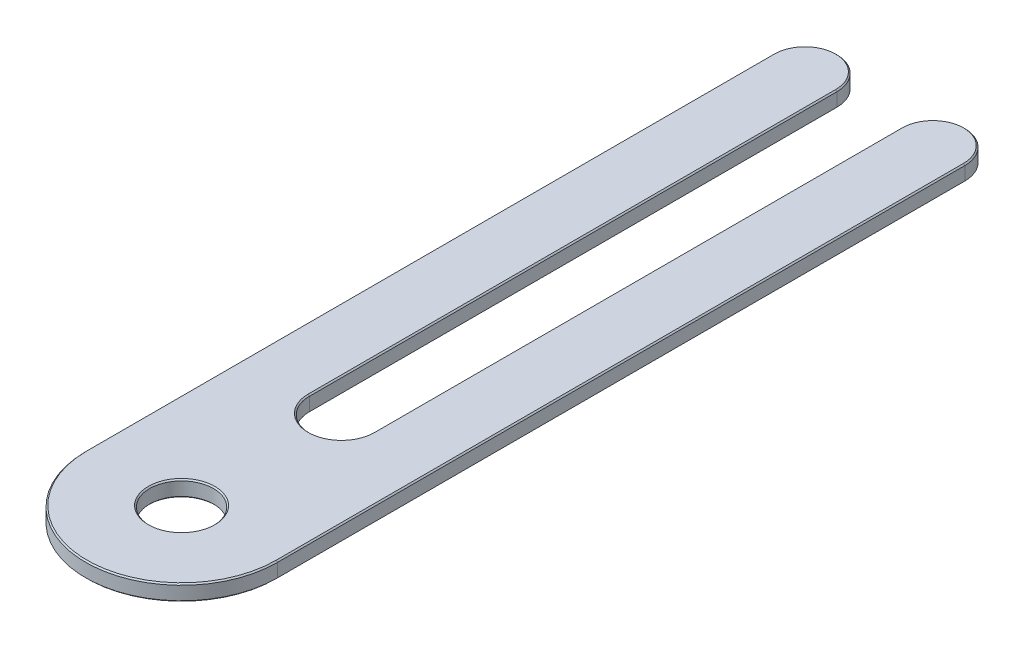
ISO-10303-21;
HEADER;
FILE_DESCRIPTION(('STEP AP214'),'2;1');
FILE_NAME('part.step','',(''),(''),'','','');
FILE_SCHEMA(('AUTOMOTIVE_DESIGN { 1 0 10303 214 1 1 1 1 }'));
ENDSEC;
DATA;
#1=APPLICATION_CONTEXT('core data for automotive mechanical design processes');
#2=APPLICATION_PROTOCOL_DEFINITION('international standard','automotive_design',2000,#1);
#3=PRODUCT_CONTEXT('',#1,'mechanical');
#4=PRODUCT('Part','Part','',(#3));
#5=PRODUCT_RELATED_PRODUCT_CATEGORY('part','',(#4));
#6=PRODUCT_DEFINITION_FORMATION('','',#4);
#7=PRODUCT_DEFINITION_CONTEXT('part definition',#1,'design');
#8=PRODUCT_DEFINITION('design','',#6,#7);
#9=PRODUCT_DEFINITION_SHAPE('','',#8);
#10=(LENGTH_UNIT() NAMED_UNIT(*) SI_UNIT(.MILLI.,.METRE.));
#11=(NAMED_UNIT(*) PLANE_ANGLE_UNIT() SI_UNIT($,.RADIAN.));
#12=(NAMED_UNIT(*) SI_UNIT($,.STERADIAN.) SOLID_ANGLE_UNIT());
#13=UNCERTAINTY_MEASURE_WITH_UNIT(LENGTH_MEASURE(1.E-05),#10,'distance_accuracy_value','');
#14=(GEOMETRIC_REPRESENTATION_CONTEXT(3) GLOBAL_UNCERTAINTY_ASSIGNED_CONTEXT((#13)) GLOBAL_UNIT_ASSIGNED_CONTEXT((#10,
#11,#12)) REPRESENTATION_CONTEXT('',''));
#15=CARTESIAN_POINT('',(0.,0.,0.));
#16=DIRECTION('',(0.,0.,1.));
#17=DIRECTION('',(1.,0.,0.));
#18=AXIS2_PLACEMENT_3D('',#15,#16,#17);
#19=CARTESIAN_POINT('',(0.,1.58749999999999,0.));
#20=DIRECTION('',(0.,1.,0.));
#21=DIRECTION('',(0.,0.,1.00000000000001));
#22=AXIS2_PLACEMENT_3D('',#19,#20,#21);
#23=PLANE('',#22);
#24=DIRECTION('',(0.,0.,1.00000000000001));
#25=VECTOR('',#24,1.);
#26=CARTESIAN_POINT('',(6.60400000000003,1.58749999999999,0.));
#27=LINE('',#26,#25);
#28=CARTESIAN_POINT('',(6.60400000000001,1.58749999999999,-104.775000000001));
#29=VERTEX_POINT('',#28);
#30=CARTESIAN_POINT('',(6.60400000000003,1.58749999999999,0.));
#31=VERTEX_POINT('',#30);
#32=EDGE_CURVE('E593',#29,#31,#27,.T.);
#33=ORIENTED_EDGE('',*,*,#32,.T.);
#34=CARTESIAN_POINT('',(0.,1.58749999999999,0.));
#35=DIRECTION('',(0.,1.,0.));
#36=DIRECTION('',(0.,0.,1.00000000000001));
#37=AXIS2_PLACEMENT_3D('',#34,#35,#36);
#38=CIRCLE('',#37,6.60399999999999);
#39=CARTESIAN_POINT('',(-6.60400000000001,1.58749999999999,0.));
#40=VERTEX_POINT('',#39);
#41=EDGE_CURVE('E854',#31,#40,#38,.F.);
#42=ORIENTED_EDGE('',*,*,#41,.T.);
#43=DIRECTION('',(0.,0.,-1.00000000000001));
#44=VECTOR('',#43,1.);
#45=CARTESIAN_POINT('',(-6.60400000000002,1.58749999999999,-104.775000000001));
#46=LINE('',#45,#44);
#47=CARTESIAN_POINT('',(-6.60400000000001,1.58749999999999,-104.775000000001));
#48=VERTEX_POINT('',#47);
#49=EDGE_CURVE('E714',#40,#48,#46,.T.);
#50=ORIENTED_EDGE('',*,*,#49,.T.);
#51=CARTESIAN_POINT('',(-12.7000000000001,1.58749999999999,-104.775000000001));
#52=DIRECTION('',(0.,1.,0.));
#53=DIRECTION('',(0.,0.,1.00000000000001));
#54=AXIS2_PLACEMENT_3D('',#51,#52,#53);
#55=CIRCLE('',#54,6.09600000000001);
#56=CARTESIAN_POINT('',(-18.7960000000002,1.58749999999999,-104.775000000001));
#57=VERTEX_POINT('',#56);
#58=EDGE_CURVE('E850',#48,#57,#55,.T.);
#59=ORIENTED_EDGE('',*,*,#58,.T.);
#60=DIRECTION('',(0.,0.,1.00000000000001));
#61=VECTOR('',#60,1.);
#62=CARTESIAN_POINT('',(-18.7960000000002,1.58749999999995,31.7500000000002));
#63=LINE('',#62,#61);
#64=CARTESIAN_POINT('',(-18.7960000000002,1.58749999999995,31.7500000000002));
#65=VERTEX_POINT('',#64);
#66=EDGE_CURVE('E846',#57,#65,#63,.T.);
#67=ORIENTED_EDGE('',*,*,#66,.T.);
#68=CARTESIAN_POINT('',(0.,1.58749999999992,31.7500000000002));
#69=DIRECTION('',(0.,1.,0.));
#70=DIRECTION('',(0.,0.,1.00000000000001));
#71=AXIS2_PLACEMENT_3D('',#68,#69,#70);
#72=CIRCLE('',#71,18.796);
#73=CARTESIAN_POINT('',(18.7960000000001,1.58749999999992,31.7500000000002));
#74=VERTEX_POINT('',#73);
#75=EDGE_CURVE('E842',#65,#74,#72,.T.);
#76=ORIENTED_EDGE('',*,*,#75,.T.);
#77=DIRECTION('',(0.,0.,-1.00000000000001));
#78=VECTOR('',#77,1.);
#79=CARTESIAN_POINT('',(18.7960000000001,1.5874999999998,-104.775000000001));
#80=LINE('',#79,#78);
#81=CARTESIAN_POINT('',(18.7960000000001,1.5874999999998,-104.775000000001));
#82=VERTEX_POINT('',#81);
#83=EDGE_CURVE('E844',#74,#82,#80,.T.);
#84=ORIENTED_EDGE('',*,*,#83,.T.);
#85=CARTESIAN_POINT('',(12.7000000000001,1.5874999999998,-104.775000000001));
#86=DIRECTION('',(0.,1.,0.));
#87=DIRECTION('',(0.,0.,1.00000000000001));
#88=AXIS2_PLACEMENT_3D('',#85,#86,#87);
#89=CIRCLE('',#88,6.09600000000001);
#90=EDGE_CURVE('E848',#82,#29,#89,.T.);
#91=ORIENTED_EDGE('',*,*,#90,.T.);
#92=EDGE_LOOP('',(#33,#42,#50,#59,#67,#76,#84,#91));
#93=FACE_BOUND('',#92,.T.);
#94=CARTESIAN_POINT('',(0.,1.58749999999992,31.7500000000002));
#95=DIRECTION('',(0.,1.,0.));
#96=DIRECTION('',(0.,0.,1.00000000000001));
#97=AXIS2_PLACEMENT_3D('',#94,#95,#96);
#98=CIRCLE('',#97,6.604);
#99=CARTESIAN_POINT('',(0.,1.58749999999992,38.3540000000002));
#100=VERTEX_POINT('',#99);
#101=EDGE_CURVE('E839',#100,#100,#98,.F.);
#102=ORIENTED_EDGE('',*,*,#101,.T.);
#103=EDGE_LOOP('',(#102));
#104=FACE_BOUND('',#103,.T.);
#105=ADVANCED_FACE('F568',(#93,#104),#23,.T.);
#106=CARTESIAN_POINT('',(0.,-1.58749999999999,0.));
#107=DIRECTION('',(0.,1.,0.));
#108=DIRECTION('',(0.,0.,1.00000000000001));
#109=AXIS2_PLACEMENT_3D('',#106,#107,#108);
#110=PLANE('',#109);
#111=DIRECTION('',(0.,0.,1.00000000000001));
#112=VECTOR('',#111,1.);
#113=CARTESIAN_POINT('',(-6.60399999999998,-1.58749999999999,0.));
#114=LINE('',#113,#112);
#115=CARTESIAN_POINT('',(-6.60399999999999,-1.58750000000002,-104.775000000001));
#116=VERTEX_POINT('',#115);
#117=CARTESIAN_POINT('',(-6.60399999999998,-1.58749999999999,0.));
#118=VERTEX_POINT('',#117);
#119=EDGE_CURVE('E810',#116,#118,#114,.T.);
#120=ORIENTED_EDGE('',*,*,#119,.T.);
#121=CARTESIAN_POINT('',(0.,-1.58749999999999,0.));
#122=DIRECTION('',(0.,1.,0.));
#123=DIRECTION('',(0.,0.,1.00000000000001));
#124=AXIS2_PLACEMENT_3D('',#121,#122,#123);
#125=CIRCLE('',#124,6.60399999999996);
#126=CARTESIAN_POINT('',(6.604,-1.58749999999999,0.));
#127=VERTEX_POINT('',#126);
#128=EDGE_CURVE('E697',#118,#127,#125,.T.);
#129=ORIENTED_EDGE('',*,*,#128,.T.);
#130=DIRECTION('',(0.,0.,-1.00000000000001));
#131=VECTOR('',#130,1.);
#132=CARTESIAN_POINT('',(6.604,-1.58749999999999,0.));
#133=LINE('',#132,#131);
#134=CARTESIAN_POINT('',(6.60399999999998,-1.58750000000002,-104.775000000001));
#135=VERTEX_POINT('',#134);
#136=EDGE_CURVE('E808',#127,#135,#133,.T.);
#137=ORIENTED_EDGE('',*,*,#136,.T.);
#138=CARTESIAN_POINT('',(12.7000000000001,-1.58750000000021,-104.775000000001));
#139=DIRECTION('',(0.,1.,0.));
#140=DIRECTION('',(0.,0.,1.00000000000001));
#141=AXIS2_PLACEMENT_3D('',#138,#139,#140);
#142=CIRCLE('',#141,6.09600000000004);
#143=CARTESIAN_POINT('',(18.7960000000001,-1.58750000000021,-104.775000000001));
#144=VERTEX_POINT('',#143);
#145=EDGE_CURVE('E804',#135,#144,#142,.F.);
#146=ORIENTED_EDGE('',*,*,#145,.T.);
#147=DIRECTION('',(0.,0.,1.00000000000001));
#148=VECTOR('',#147,1.);
#149=CARTESIAN_POINT('',(18.7960000000001,-1.58749999999999,0.));
#150=LINE('',#149,#148);
#151=CARTESIAN_POINT('',(18.7960000000002,-1.58750000000006,31.7500000000002));
#152=VERTEX_POINT('',#151);
#153=EDGE_CURVE('E800',#144,#152,#150,.T.);
#154=ORIENTED_EDGE('',*,*,#153,.T.);
#155=CARTESIAN_POINT('',(0.,-1.58750000000006,31.7500000000002));
#156=DIRECTION('',(0.,1.,0.));
#157=DIRECTION('',(0.,0.,1.00000000000001));
#158=AXIS2_PLACEMENT_3D('',#155,#156,#157);
#159=CIRCLE('',#158,18.796);
#160=CARTESIAN_POINT('',(-18.7960000000002,-1.58750000000006,31.7500000000002));
#161=VERTEX_POINT('',#160);
#162=EDGE_CURVE('E798',#152,#161,#159,.F.);
#163=ORIENTED_EDGE('',*,*,#162,.T.);
#164=DIRECTION('',(0.,0.,-1.00000000000001));
#165=VECTOR('',#164,1.);
#166=CARTESIAN_POINT('',(-18.7960000000002,-1.58749999999999,0.));
#167=LINE('',#166,#165);
#168=CARTESIAN_POINT('',(-18.7960000000002,-1.58750000000002,-104.775000000001));
#169=VERTEX_POINT('',#168);
#170=EDGE_CURVE('E802',#161,#169,#167,.T.);
#171=ORIENTED_EDGE('',*,*,#170,.T.);
#172=CARTESIAN_POINT('',(-12.7000000000001,-1.58750000000002,-104.775000000001));
#173=DIRECTION('',(0.,1.,0.));
#174=DIRECTION('',(0.,0.,1.00000000000001));
#175=AXIS2_PLACEMENT_3D('',#172,#173,#174);
#176=CIRCLE('',#175,6.09600000000004);
#177=EDGE_CURVE('E806',#169,#116,#176,.F.);
#178=ORIENTED_EDGE('',*,*,#177,.T.);
#179=EDGE_LOOP('',(#120,#129,#137,#146,#154,#163,#171,#178));
#180=FACE_BOUND('',#179,.T.);
#181=CARTESIAN_POINT('',(0.,-1.58750000000006,31.7500000000002));
#182=DIRECTION('',(0.,1.,0.));
#183=DIRECTION('',(0.,0.,1.00000000000001));
#184=AXIS2_PLACEMENT_3D('',#181,#182,#183);
#185=CIRCLE('',#184,6.604);
#186=CARTESIAN_POINT('',(0.,-1.58750000000006,38.3540000000002));
#187=VERTEX_POINT('',#186);
#188=EDGE_CURVE('E795',#187,#187,#185,.T.);
#189=ORIENTED_EDGE('',*,*,#188,.T.);
#190=EDGE_LOOP('',(#189));
#191=FACE_BOUND('',#190,.T.);
#192=ADVANCED_FACE('F869',(#180,#191),#110,.F.);
#193=CARTESIAN_POINT('',(0.,1.58749999999999,0.));
#194=DIRECTION('',(0.,-1.,0.));
#195=DIRECTION('',(0.,0.,-1.00000000000001));
#196=AXIS2_PLACEMENT_3D('',#193,#194,#195);
#197=CYLINDRICAL_SURFACE('',#196,6.35);
#198=DIRECTION('',(0.,-1.,0.));
#199=VECTOR('',#198,1.);
#200=CARTESIAN_POINT('',(6.35000000000004,1.58749999999999,0.));
#201=LINE('',#200,#199);
#202=CARTESIAN_POINT('',(6.35000000000004,1.33350000000002,0.));
#203=VERTEX_POINT('',#202);
#204=CARTESIAN_POINT('',(6.35000000000004,-1.33350000000004,0.));
#205=VERTEX_POINT('',#204);
#206=EDGE_CURVE('E770',#203,#205,#201,.T.);
#207=ORIENTED_EDGE('',*,*,#206,.T.);
#208=CARTESIAN_POINT('',(0.,-1.33350000000004,0.));
#209=DIRECTION('',(0.,1.,0.));
#210=DIRECTION('',(0.,0.,1.00000000000001));
#211=AXIS2_PLACEMENT_3D('',#208,#209,#210);
#212=CIRCLE('',#211,6.35);
#213=CARTESIAN_POINT('',(-6.35000000000002,-1.33350000000004,0.));
#214=VERTEX_POINT('',#213);
#215=EDGE_CURVE('E707',#205,#214,#212,.F.);
#216=ORIENTED_EDGE('',*,*,#215,.T.);
#217=DIRECTION('',(0.,-1.,0.));
#218=VECTOR('',#217,1.);
#219=CARTESIAN_POINT('',(-6.35000000000002,1.58749999999999,0.));
#220=LINE('',#219,#218);
#221=CARTESIAN_POINT('',(-6.35000000000002,1.33350000000002,0.));
#222=VERTEX_POINT('',#221);
#223=EDGE_CURVE('E690',#222,#214,#220,.T.);
#224=ORIENTED_EDGE('',*,*,#223,.F.);
#225=CARTESIAN_POINT('',(0.,1.33350000000002,0.));
#226=DIRECTION('',(0.,1.,0.));
#227=DIRECTION('',(0.,0.,1.00000000000001));
#228=AXIS2_PLACEMENT_3D('',#225,#226,#227);
#229=CIRCLE('',#228,6.35);
#230=EDGE_CURVE('E704',#222,#203,#229,.T.);
#231=ORIENTED_EDGE('',*,*,#230,.T.);
#232=EDGE_LOOP('',(#207,#216,#224,#231));
#233=FACE_BOUND('',#232,.T.);
#234=ADVANCED_FACE('F703',(#233),#197,.F.);
#235=CARTESIAN_POINT('',(-6.35000000000002,1.58749999999999,0.));
#236=DIRECTION('',(-1.00000000000001,0.,0.));
#237=DIRECTION('',(0.,0.,1.00000000000001));
#238=AXIS2_PLACEMENT_3D('',#235,#236,#237);
#239=PLANE('',#238);
#240=ORIENTED_EDGE('',*,*,#223,.T.);
#241=DIRECTION('',(0.,0.,-1.00000000000001));
#242=VECTOR('',#241,1.);
#243=CARTESIAN_POINT('',(-6.35000000000002,-1.33350000000004,0.));
#244=LINE('',#243,#242);
#245=CARTESIAN_POINT('',(-6.35000000000003,-1.33350000000004,-104.775000000001));
#246=VERTEX_POINT('',#245);
#247=EDGE_CURVE('E696',#214,#246,#244,.T.);
#248=ORIENTED_EDGE('',*,*,#247,.T.);
#249=DIRECTION('',(0.,-1.,0.));
#250=VECTOR('',#249,1.);
#251=CARTESIAN_POINT('',(-6.35000000000003,1.58749999999999,-104.775000000001));
#252=LINE('',#251,#250);
#253=CARTESIAN_POINT('',(-6.35000000000003,1.33349999999999,-104.775000000001));
#254=VERTEX_POINT('',#253);
#255=EDGE_CURVE('E692',#254,#246,#252,.T.);
#256=ORIENTED_EDGE('',*,*,#255,.F.);
#257=DIRECTION('',(0.,0.,1.00000000000001));
#258=VECTOR('',#257,1.);
#259=CARTESIAN_POINT('',(-6.35000000000002,1.33350000000002,0.));
#260=LINE('',#259,#258);
#261=EDGE_CURVE('E687',#254,#222,#260,.T.);
#262=ORIENTED_EDGE('',*,*,#261,.T.);
#263=EDGE_LOOP('',(#240,#248,#256,#262));
#264=FACE_BOUND('',#263,.T.);
#265=ADVANCED_FACE('F689',(#264),#239,.F.);
#266=CARTESIAN_POINT('',(-12.7000000000001,1.58749999999999,-104.775000000001));
#267=DIRECTION('',(0.,-1.,0.));
#268=DIRECTION('',(0.,0.,-1.00000000000001));
#269=AXIS2_PLACEMENT_3D('',#266,#267,#268);
#270=CYLINDRICAL_SURFACE('',#269,6.35);
#271=ORIENTED_EDGE('',*,*,#255,.T.);
#272=CARTESIAN_POINT('',(-12.7000000000001,-1.33350000000004,-104.775000000001));
#273=DIRECTION('',(0.,1.,0.));
#274=DIRECTION('',(0.,0.,1.00000000000001));
#275=AXIS2_PLACEMENT_3D('',#272,#273,#274);
#276=CIRCLE('',#275,6.35);
#277=CARTESIAN_POINT('',(-19.0500000000001,-1.33350000000004,-104.775000000001));
#278=VERTEX_POINT('',#277);
#279=EDGE_CURVE('E821',#246,#278,#276,.T.);
#280=ORIENTED_EDGE('',*,*,#279,.T.);
#281=DIRECTION('',(0.,-1.,0.));
#282=VECTOR('',#281,1.);
#283=CARTESIAN_POINT('',(-19.0500000000001,1.58749999999999,-104.775000000001));
#284=LINE('',#283,#282);
#285=CARTESIAN_POINT('',(-19.0500000000001,1.33349999999999,-104.775000000001));
#286=VERTEX_POINT('',#285);
#287=EDGE_CURVE('E790',#286,#278,#284,.T.);
#288=ORIENTED_EDGE('',*,*,#287,.F.);
#289=CARTESIAN_POINT('',(-12.7000000000001,1.33349999999999,-104.775000000001));
#290=DIRECTION('',(0.,1.,0.));
#291=DIRECTION('',(0.,0.,1.00000000000001));
#292=AXIS2_PLACEMENT_3D('',#289,#290,#291);
#293=CIRCLE('',#292,6.35);
#294=EDGE_CURVE('E819',#286,#254,#293,.F.);
#295=ORIENTED_EDGE('',*,*,#294,.T.);
#296=EDGE_LOOP('',(#271,#280,#288,#295));
#297=FACE_BOUND('',#296,.T.);
#298=ADVANCED_FACE('F898',(#297),#270,.T.);
#299=CARTESIAN_POINT('',(-19.0500000000001,1.58749999999999,-104.775000000001));
#300=DIRECTION('',(1.00000000000001,0.,0.));
#301=DIRECTION('',(0.,0.,-1.00000000000001));
#302=AXIS2_PLACEMENT_3D('',#299,#300,#301);
#303=PLANE('',#302);
#304=ORIENTED_EDGE('',*,*,#287,.T.);
#305=DIRECTION('',(0.,0.,1.00000000000001));
#306=VECTOR('',#305,1.);
#307=CARTESIAN_POINT('',(-19.0500000000001,-1.33350000000004,-104.775000000001));
#308=LINE('',#307,#306);
#309=CARTESIAN_POINT('',(-19.0500000000002,-1.33350000000008,31.7500000000003));
#310=VERTEX_POINT('',#309);
#311=EDGE_CURVE('E829',#278,#310,#308,.T.);
#312=ORIENTED_EDGE('',*,*,#311,.T.);
#313=DIRECTION('',(0.,-1.,0.));
#314=VECTOR('',#313,1.);
#315=CARTESIAN_POINT('',(-19.0500000000002,1.58749999999995,31.7500000000003));
#316=LINE('',#315,#314);
#317=CARTESIAN_POINT('',(-19.0500000000002,1.33349999999995,31.7500000000003));
#318=VERTEX_POINT('',#317);
#319=EDGE_CURVE('E787',#318,#310,#316,.T.);
#320=ORIENTED_EDGE('',*,*,#319,.F.);
#321=DIRECTION('',(0.,0.,-1.00000000000001));
#322=VECTOR('',#321,1.);
#323=CARTESIAN_POINT('',(-19.0500000000001,1.33349999999999,-104.775000000001));
#324=LINE('',#323,#322);
#325=EDGE_CURVE('E827',#318,#286,#324,.T.);
#326=ORIENTED_EDGE('',*,*,#325,.T.);
#327=EDGE_LOOP('',(#304,#312,#320,#326));
#328=FACE_BOUND('',#327,.T.);
#329=ADVANCED_FACE('F894',(#328),#303,.F.);
#330=CARTESIAN_POINT('',(0.,1.58749999999992,31.7500000000002));
#331=DIRECTION('',(0.,-1.,0.));
#332=DIRECTION('',(0.,0.,-1.00000000000001));
#333=AXIS2_PLACEMENT_3D('',#330,#331,#332);
#334=CYLINDRICAL_SURFACE('',#333,19.05);
#335=ORIENTED_EDGE('',*,*,#319,.T.);
#336=CARTESIAN_POINT('',(0.,-1.33350000000008,31.7500000000002));
#337=DIRECTION('',(0.,1.,0.));
#338=DIRECTION('',(0.,0.,1.00000000000001));
#339=AXIS2_PLACEMENT_3D('',#336,#337,#338);
#340=CIRCLE('',#339,19.05);
#341=CARTESIAN_POINT('',(19.0500000000001,-1.33350000000008,31.7500000000002));
#342=VERTEX_POINT('',#341);
#343=EDGE_CURVE('E837',#310,#342,#340,.T.);
#344=ORIENTED_EDGE('',*,*,#343,.T.);
#345=DIRECTION('',(0.,-1.,0.));
#346=VECTOR('',#345,1.);
#347=CARTESIAN_POINT('',(19.0500000000001,1.58749999999992,31.7500000000002));
#348=LINE('',#347,#346);
#349=CARTESIAN_POINT('',(19.0500000000001,1.33349999999995,31.7500000000002));
#350=VERTEX_POINT('',#349);
#351=EDGE_CURVE('E784',#350,#342,#348,.T.);
#352=ORIENTED_EDGE('',*,*,#351,.F.);
#353=CARTESIAN_POINT('',(0.,1.33349999999995,31.7500000000002));
#354=DIRECTION('',(0.,1.,0.));
#355=DIRECTION('',(0.,0.,1.00000000000001));
#356=AXIS2_PLACEMENT_3D('',#353,#354,#355);
#357=CIRCLE('',#356,19.05);
#358=EDGE_CURVE('E835',#350,#318,#357,.F.);
#359=ORIENTED_EDGE('',*,*,#358,.T.);
#360=EDGE_LOOP('',(#335,#344,#352,#359));
#361=FACE_BOUND('',#360,.T.);
#362=ADVANCED_FACE('F890',(#361),#334,.T.);
#363=CARTESIAN_POINT('',(19.0500000000001,1.5874999999998,-104.775000000001));
#364=DIRECTION('',(-1.00000000000001,0.,0.));
#365=DIRECTION('',(0.,0.,1.00000000000001));
#366=AXIS2_PLACEMENT_3D('',#363,#364,#365);
#367=PLANE('',#366);
#368=ORIENTED_EDGE('',*,*,#351,.T.);
#369=DIRECTION('',(0.,0.,-1.00000000000001));
#370=VECTOR('',#369,1.);
#371=CARTESIAN_POINT('',(19.0500000000001,-1.33350000000024,-104.775000000001));
#372=LINE('',#371,#370);
#373=CARTESIAN_POINT('',(19.0500000000001,-1.33350000000024,-104.775000000001));
#374=VERTEX_POINT('',#373);
#375=EDGE_CURVE('E833',#342,#374,#372,.T.);
#376=ORIENTED_EDGE('',*,*,#375,.T.);
#377=DIRECTION('',(0.,-1.,0.));
#378=VECTOR('',#377,1.);
#379=CARTESIAN_POINT('',(19.0500000000001,1.5874999999998,-104.775000000001));
#380=LINE('',#379,#378);
#381=CARTESIAN_POINT('',(19.0500000000001,1.33349999999979,-104.775000000001));
#382=VERTEX_POINT('',#381);
#383=EDGE_CURVE('E779',#382,#374,#380,.T.);
#384=ORIENTED_EDGE('',*,*,#383,.F.);
#385=DIRECTION('',(0.,0.,1.00000000000001));
#386=VECTOR('',#385,1.);
#387=CARTESIAN_POINT('',(19.0500000000001,1.33349999999995,31.7500000000002));
#388=LINE('',#387,#386);
#389=EDGE_CURVE('E831',#382,#350,#388,.T.);
#390=ORIENTED_EDGE('',*,*,#389,.T.);
#391=EDGE_LOOP('',(#368,#376,#384,#390));
#392=FACE_BOUND('',#391,.T.);
#393=ADVANCED_FACE('F886',(#392),#367,.F.);
#394=CARTESIAN_POINT('',(12.7000000000001,1.5874999999998,-104.775000000001));
#395=DIRECTION('',(0.,-1.,0.));
#396=DIRECTION('',(0.,0.,-1.00000000000001));
#397=AXIS2_PLACEMENT_3D('',#394,#395,#396);
#398=CYLINDRICAL_SURFACE('',#397,6.35);
#399=ORIENTED_EDGE('',*,*,#383,.T.);
#400=CARTESIAN_POINT('',(12.7000000000001,-1.33350000000024,-104.775000000001));
#401=DIRECTION('',(0.,1.,0.));
#402=DIRECTION('',(0.,0.,1.00000000000001));
#403=AXIS2_PLACEMENT_3D('',#400,#401,#402);
#404=CIRCLE('',#403,6.35);
#405=CARTESIAN_POINT('',(6.35000000000003,-1.33350000000004,-104.775000000001));
#406=VERTEX_POINT('',#405);
#407=EDGE_CURVE('E825',#374,#406,#404,.T.);
#408=ORIENTED_EDGE('',*,*,#407,.T.);
#409=DIRECTION('',(0.,-1.,0.));
#410=VECTOR('',#409,1.);
#411=CARTESIAN_POINT('',(6.35000000000003,1.58749999999999,-104.775000000001));
#412=LINE('',#411,#410);
#413=CARTESIAN_POINT('',(6.35000000000003,1.33349999999999,-104.775000000001));
#414=VERTEX_POINT('',#413);
#415=EDGE_CURVE('E775',#414,#406,#412,.T.);
#416=ORIENTED_EDGE('',*,*,#415,.F.);
#417=CARTESIAN_POINT('',(12.7000000000001,1.33349999999979,-104.775000000001));
#418=DIRECTION('',(0.,1.,0.));
#419=DIRECTION('',(0.,0.,1.00000000000001));
#420=AXIS2_PLACEMENT_3D('',#417,#418,#419);
#421=CIRCLE('',#420,6.35);
#422=EDGE_CURVE('E823',#414,#382,#421,.F.);
#423=ORIENTED_EDGE('',*,*,#422,.T.);
#424=EDGE_LOOP('',(#399,#408,#416,#423));
#425=FACE_BOUND('',#424,.T.);
#426=ADVANCED_FACE('F882',(#425),#398,.T.);
#427=CARTESIAN_POINT('',(6.35000000000004,1.58749999999999,0.));
#428=DIRECTION('',(1.00000000000001,0.,0.));
#429=DIRECTION('',(0.,0.,-1.00000000000001));
#430=AXIS2_PLACEMENT_3D('',#427,#428,#429);
#431=PLANE('',#430);
#432=ORIENTED_EDGE('',*,*,#415,.T.);
#433=DIRECTION('',(0.,0.,1.00000000000001));
#434=VECTOR('',#433,1.);
#435=CARTESIAN_POINT('',(6.35000000000004,-1.33350000000004,0.));
#436=LINE('',#435,#434);
#437=EDGE_CURVE('E817',#406,#205,#436,.T.);
#438=ORIENTED_EDGE('',*,*,#437,.T.);
#439=ORIENTED_EDGE('',*,*,#206,.F.);
#440=DIRECTION('',(0.,0.,-1.00000000000001));
#441=VECTOR('',#440,1.);
#442=CARTESIAN_POINT('',(6.35000000000003,1.33349999999999,-104.775000000001));
#443=LINE('',#442,#441);
#444=EDGE_CURVE('E815',#203,#414,#443,.T.);
#445=ORIENTED_EDGE('',*,*,#444,.T.);
#446=EDGE_LOOP('',(#432,#438,#439,#445));
#447=FACE_BOUND('',#446,.T.);
#448=ADVANCED_FACE('F879',(#447),#431,.F.);
#449=CARTESIAN_POINT('',(0.,1.58749999999992,31.7500000000002));
#450=DIRECTION('',(0.,-1.,0.));
#451=DIRECTION('',(0.,0.,-1.00000000000001));
#452=AXIS2_PLACEMENT_3D('',#449,#450,#451);
#453=CYLINDRICAL_SURFACE('',#452,6.35);
#454=CARTESIAN_POINT('',(0.,-1.33350000000006,31.7500000000002));
#455=DIRECTION('',(0.,1.,0.));
#456=DIRECTION('',(0.,0.,1.00000000000001));
#457=AXIS2_PLACEMENT_3D('',#454,#455,#456);
#458=CIRCLE('',#457,6.35);
#459=CARTESIAN_POINT('',(0.,-1.33350000000006,38.1000000000002));
#460=VERTEX_POINT('',#459);
#461=EDGE_CURVE('E12',#460,#460,#458,.F.);
#462=ORIENTED_EDGE('',*,*,#461,.T.);
#463=EDGE_LOOP('',(#462));
#464=FACE_BOUND('',#463,.T.);
#465=CARTESIAN_POINT('',(0.,1.33349999999995,31.7500000000002));
#466=DIRECTION('',(0.,1.,0.));
#467=DIRECTION('',(0.,0.,1.00000000000001));
#468=AXIS2_PLACEMENT_3D('',#465,#466,#467);
#469=CIRCLE('',#468,6.35);
#470=CARTESIAN_POINT('',(0.,1.33349999999995,38.1000000000002));
#471=VERTEX_POINT('',#470);
#472=EDGE_CURVE('E577',#471,#471,#469,.T.);
#473=ORIENTED_EDGE('',*,*,#472,.T.);
#474=EDGE_LOOP('',(#473));
#475=FACE_BOUND('',#474,.T.);
#476=ADVANCED_FACE('F858',(#464,#475),#453,.F.);
#477=CARTESIAN_POINT('',(0.,-1.33350000000008,31.7500000000002));
#478=DIRECTION('',(0.,1.,0.));
#479=DIRECTION('',(0.,0.,1.00000000000001));
#480=AXIS2_PLACEMENT_3D('',#477,#478,#479);
#481=CONICAL_SURFACE('',#480,19.05,0.785398163397435);
#482=DIRECTION('',(-0.707106781186541,0.707106781186557,0.));
#483=VECTOR('',#482,1.);
#484=CARTESIAN_POINT('',(-18.7960000000002,-1.58750000000006,31.7500000000002));
#485=LINE('',#484,#483);
#486=EDGE_CURVE('E763',#161,#310,#485,.T.);
#487=ORIENTED_EDGE('',*,*,#486,.F.);
#488=ORIENTED_EDGE('',*,*,#162,.F.);
#489=DIRECTION('',(-0.707106781186541,-0.707106781186557,0.));
#490=VECTOR('',#489,1.);
#491=CARTESIAN_POINT('',(19.0500000000001,-1.33350000000008,31.7500000000002));
#492=LINE('',#491,#490);
#493=EDGE_CURVE('E719',#342,#152,#492,.T.);
#494=ORIENTED_EDGE('',*,*,#493,.F.);
#495=ORIENTED_EDGE('',*,*,#343,.F.);
#496=EDGE_LOOP('',(#487,#488,#494,#495));
#497=FACE_BOUND('',#496,.T.);
#498=ADVANCED_FACE('F933',(#497),#481,.T.);
#499=CARTESIAN_POINT('',(19.0500000000001,-1.33350000000024,-104.775000000001));
#500=DIRECTION('',(-0.707106781186563,0.707106781186536,0.));
#501=DIRECTION('',(-0.707106781186539,-0.70710678118656,0.));
#502=AXIS2_PLACEMENT_3D('',#499,#500,#501);
#503=PLANE('',#502);
#504=ORIENTED_EDGE('',*,*,#493,.T.);
#505=ORIENTED_EDGE('',*,*,#153,.F.);
#506=DIRECTION('',(-0.707106781186541,-0.707106781186557,0.));
#507=VECTOR('',#506,1.);
#508=CARTESIAN_POINT('',(19.0500000000001,-1.33350000000024,-104.775000000001));
#509=LINE('',#508,#507);
#510=EDGE_CURVE('E761',#374,#144,#509,.T.);
#511=ORIENTED_EDGE('',*,*,#510,.F.);
#512=ORIENTED_EDGE('',*,*,#375,.F.);
#513=EDGE_LOOP('',(#504,#505,#511,#512));
#514=FACE_BOUND('',#513,.T.);
#515=ADVANCED_FACE('F930',(#514),#503,.F.);
#516=CARTESIAN_POINT('',(-19.0500000000001,-1.33350000000004,-104.775000000001));
#517=DIRECTION('',(0.707106781186563,0.707106781186536,0.));
#518=DIRECTION('',(-0.707106781186539,0.70710678118656,0.));
#519=AXIS2_PLACEMENT_3D('',#516,#517,#518);
#520=PLANE('',#519);
#521=ORIENTED_EDGE('',*,*,#486,.T.);
#522=ORIENTED_EDGE('',*,*,#311,.F.);
#523=DIRECTION('',(-0.707106781186541,0.707106781186557,0.));
#524=VECTOR('',#523,1.);
#525=CARTESIAN_POINT('',(-18.7960000000002,-1.58750000000002,-104.775000000001));
#526=LINE('',#525,#524);
#527=EDGE_CURVE('E758',#169,#278,#526,.T.);
#528=ORIENTED_EDGE('',*,*,#527,.F.);
#529=ORIENTED_EDGE('',*,*,#170,.F.);
#530=EDGE_LOOP('',(#521,#522,#528,#529));
#531=FACE_BOUND('',#530,.T.);
#532=ADVANCED_FACE('F926',(#531),#520,.F.);
#533=CARTESIAN_POINT('',(12.7000000000001,-1.33350000000024,-104.775000000001));
#534=DIRECTION('',(0.,1.,0.));
#535=DIRECTION('',(0.,0.,1.00000000000001));
#536=AXIS2_PLACEMENT_3D('',#533,#534,#535);
#537=CONICAL_SURFACE('',#536,6.35,0.785398163397431);
#538=ORIENTED_EDGE('',*,*,#510,.T.);
#539=ORIENTED_EDGE('',*,*,#145,.F.);
#540=DIRECTION('',(0.707106781186539,-0.70710678118656,0.));
#541=VECTOR('',#540,1.);
#542=CARTESIAN_POINT('',(6.35000000000002,-1.33350000000004,-104.775000000001));
#543=LINE('',#542,#541);
#544=EDGE_CURVE('E755',#406,#135,#543,.T.);
#545=ORIENTED_EDGE('',*,*,#544,.F.);
#546=ORIENTED_EDGE('',*,*,#407,.F.);
#547=EDGE_LOOP('',(#538,#539,#545,#546));
#548=FACE_BOUND('',#547,.T.);
#549=ADVANCED_FACE('F922',(#548),#537,.T.);
#550=CARTESIAN_POINT('',(-12.7000000000001,-1.33350000000004,-104.775000000001));
#551=DIRECTION('',(0.,1.,0.));
#552=DIRECTION('',(0.,0.,1.00000000000001));
#553=AXIS2_PLACEMENT_3D('',#550,#551,#552);
#554=CONICAL_SURFACE('',#553,6.35,0.785398163397435);
#555=ORIENTED_EDGE('',*,*,#527,.T.);
#556=ORIENTED_EDGE('',*,*,#279,.F.);
#557=DIRECTION('',(0.707106781186541,0.707106781186557,0.));
#558=VECTOR('',#557,1.);
#559=CARTESIAN_POINT('',(-6.60399999999999,-1.58750000000002,-104.775000000001));
#560=LINE('',#559,#558);
#561=EDGE_CURVE('E749',#116,#246,#560,.T.);
#562=ORIENTED_EDGE('',*,*,#561,.F.);
#563=ORIENTED_EDGE('',*,*,#177,.F.);
#564=EDGE_LOOP('',(#555,#556,#562,#563));
#565=FACE_BOUND('',#564,.T.);
#566=ADVANCED_FACE('F918',(#565),#554,.T.);
#567=CARTESIAN_POINT('',(6.35000000000004,-1.33350000000004,0.));
#568=DIRECTION('',(0.70710678118656,0.707106781186538,0.));
#569=DIRECTION('',(-0.707106781186541,0.707106781186557,0.));
#570=AXIS2_PLACEMENT_3D('',#567,#568,#569);
#571=PLANE('',#570);
#572=ORIENTED_EDGE('',*,*,#544,.T.);
#573=ORIENTED_EDGE('',*,*,#136,.F.);
#574=DIRECTION('',(0.707106781186541,-0.707106781186557,0.));
#575=VECTOR('',#574,1.);
#576=CARTESIAN_POINT('',(6.35000000000004,-1.33350000000004,0.));
#577=LINE('',#576,#575);
#578=EDGE_CURVE('E743',#205,#127,#577,.T.);
#579=ORIENTED_EDGE('',*,*,#578,.F.);
#580=ORIENTED_EDGE('',*,*,#437,.F.);
#581=EDGE_LOOP('',(#572,#573,#579,#580));
#582=FACE_BOUND('',#581,.T.);
#583=ADVANCED_FACE('F914',(#582),#571,.F.);
#584=CARTESIAN_POINT('',(-6.35000000000002,-1.33350000000004,0.));
#585=DIRECTION('',(-0.70710678118656,0.707106781186538,0.));
#586=DIRECTION('',(-0.707106781186541,-0.707106781186557,0.));
#587=AXIS2_PLACEMENT_3D('',#584,#585,#586);
#588=PLANE('',#587);
#589=ORIENTED_EDGE('',*,*,#561,.T.);
#590=ORIENTED_EDGE('',*,*,#247,.F.);
#591=DIRECTION('',(0.707106781186541,0.707106781186557,0.));
#592=VECTOR('',#591,1.);
#593=CARTESIAN_POINT('',(-6.60399999999998,-1.58749999999999,0.));
#594=LINE('',#593,#592);
#595=EDGE_CURVE('E738',#118,#214,#594,.T.);
#596=ORIENTED_EDGE('',*,*,#595,.F.);
#597=ORIENTED_EDGE('',*,*,#119,.F.);
#598=EDGE_LOOP('',(#589,#590,#596,#597));
#599=FACE_BOUND('',#598,.T.);
#600=ADVANCED_FACE('F911',(#599),#588,.F.);
#601=CARTESIAN_POINT('',(0.,-1.33350000000004,0.));
#602=DIRECTION('',(0.,-1.,0.));
#603=DIRECTION('',(0.,0.,-1.00000000000001));
#604=AXIS2_PLACEMENT_3D('',#601,#602,#603);
#605=CONICAL_SURFACE('',#604,6.35,0.785398163397435);
#606=ORIENTED_EDGE('',*,*,#578,.T.);
#607=ORIENTED_EDGE('',*,*,#128,.F.);
#608=ORIENTED_EDGE('',*,*,#595,.T.);
#609=ORIENTED_EDGE('',*,*,#215,.F.);
#610=EDGE_LOOP('',(#606,#607,#608,#609));
#611=FACE_BOUND('',#610,.T.);
#612=ADVANCED_FACE('F907',(#611),#605,.F.);
#613=CARTESIAN_POINT('',(0.,1.58749999999992,31.7500000000002));
#614=DIRECTION('',(0.,-1.,0.));
#615=DIRECTION('',(0.,0.,-1.00000000000001));
#616=AXIS2_PLACEMENT_3D('',#613,#614,#615);
#617=CONICAL_SURFACE('',#616,18.796,0.785398163397448);
#618=DIRECTION('',(0.707106781186551,0.707106781186547,0.));
#619=VECTOR('',#618,1.);
#620=CARTESIAN_POINT('',(-19.0500000000002,1.33349999999995,31.7500000000003));
#621=LINE('',#620,#619);
#622=EDGE_CURVE('E731',#318,#65,#621,.T.);
#623=ORIENTED_EDGE('',*,*,#622,.F.);
#624=ORIENTED_EDGE('',*,*,#358,.F.);
#625=DIRECTION('',(0.707106781186551,-0.707106781186547,0.));
#626=VECTOR('',#625,1.);
#627=CARTESIAN_POINT('',(18.7960000000001,1.58749999999992,31.7500000000002));
#628=LINE('',#627,#626);
#629=EDGE_CURVE('E572',#74,#350,#628,.T.);
#630=ORIENTED_EDGE('',*,*,#629,.F.);
#631=ORIENTED_EDGE('',*,*,#75,.F.);
#632=EDGE_LOOP('',(#623,#624,#630,#631));
#633=FACE_BOUND('',#632,.T.);
#634=ADVANCED_FACE('F910',(#633),#617,.T.);
#635=CARTESIAN_POINT('',(18.7960000000001,1.58749999999999,0.));
#636=DIRECTION('',(0.707106781186553,0.707106781186545,0.));
#637=DIRECTION('',(-0.707106781186548,0.70710678118655,0.));
#638=AXIS2_PLACEMENT_3D('',#635,#636,#637);
#639=PLANE('',#638);
#640=ORIENTED_EDGE('',*,*,#629,.T.);
#641=ORIENTED_EDGE('',*,*,#389,.F.);
#642=DIRECTION('',(0.707106781186551,-0.707106781186547,0.));
#643=VECTOR('',#642,1.);
#644=CARTESIAN_POINT('',(18.7960000000001,1.5874999999998,-104.775000000001));
#645=LINE('',#644,#643);
#646=EDGE_CURVE('E729',#82,#382,#645,.T.);
#647=ORIENTED_EDGE('',*,*,#646,.F.);
#648=ORIENTED_EDGE('',*,*,#83,.F.);
#649=EDGE_LOOP('',(#640,#641,#647,#648));
#650=FACE_BOUND('',#649,.T.);
#651=ADVANCED_FACE('F956',(#650),#639,.T.);
#652=CARTESIAN_POINT('',(-18.7960000000002,1.58749999999999,0.));
#653=DIRECTION('',(-0.707106781186553,0.707106781186545,0.));
#654=DIRECTION('',(-0.707106781186548,-0.70710678118655,0.));
#655=AXIS2_PLACEMENT_3D('',#652,#653,#654);
#656=PLANE('',#655);
#657=ORIENTED_EDGE('',*,*,#622,.T.);
#658=ORIENTED_EDGE('',*,*,#66,.F.);
#659=DIRECTION('',(0.707106781186551,0.707106781186547,0.));
#660=VECTOR('',#659,1.);
#661=CARTESIAN_POINT('',(-19.0500000000001,1.33349999999999,-104.775000000001));
#662=LINE('',#661,#660);
#663=EDGE_CURVE('E726',#286,#57,#662,.T.);
#664=ORIENTED_EDGE('',*,*,#663,.F.);
#665=ORIENTED_EDGE('',*,*,#325,.F.);
#666=EDGE_LOOP('',(#657,#658,#664,#665));
#667=FACE_BOUND('',#666,.T.);
#668=ADVANCED_FACE('F952',(#667),#656,.T.);
#669=CARTESIAN_POINT('',(12.7000000000001,1.5874999999998,-104.775000000001));
#670=DIRECTION('',(0.,-1.,0.));
#671=DIRECTION('',(0.,0.,-1.00000000000001));
#672=AXIS2_PLACEMENT_3D('',#669,#670,#671);
#673=CONICAL_SURFACE('',#672,6.09600000000001,0.785398163397448);
#674=ORIENTED_EDGE('',*,*,#646,.T.);
#675=ORIENTED_EDGE('',*,*,#422,.F.);
#676=DIRECTION('',(-0.707106781186551,-0.707106781186547,0.));
#677=VECTOR('',#676,1.);
#678=CARTESIAN_POINT('',(6.60400000000001,1.58749999999999,-104.775000000001));
#679=LINE('',#678,#677);
#680=EDGE_CURVE('E723',#29,#414,#679,.T.);
#681=ORIENTED_EDGE('',*,*,#680,.F.);
#682=ORIENTED_EDGE('',*,*,#90,.F.);
#683=EDGE_LOOP('',(#674,#675,#681,#682));
#684=FACE_BOUND('',#683,.T.);
#685=ADVANCED_FACE('F948',(#684),#673,.T.);
#686=CARTESIAN_POINT('',(-12.7000000000001,1.58749999999999,-104.775000000001));
#687=DIRECTION('',(0.,-1.,0.));
#688=DIRECTION('',(0.,0.,-1.00000000000001));
#689=AXIS2_PLACEMENT_3D('',#686,#687,#688);
#690=CONICAL_SURFACE('',#689,6.09600000000001,0.785398163397445);
#691=ORIENTED_EDGE('',*,*,#663,.T.);
#692=ORIENTED_EDGE('',*,*,#58,.F.);
#693=DIRECTION('',(-0.707106781186548,0.70710678118655,0.));
#694=VECTOR('',#693,1.);
#695=CARTESIAN_POINT('',(-6.35000000000003,1.33349999999999,-104.775000000001));
#696=LINE('',#695,#694);
#697=EDGE_CURVE('E716',#254,#48,#696,.T.);
#698=ORIENTED_EDGE('',*,*,#697,.F.);
#699=ORIENTED_EDGE('',*,*,#294,.F.);
#700=EDGE_LOOP('',(#691,#692,#698,#699));
#701=FACE_BOUND('',#700,.T.);
#702=ADVANCED_FACE('F944',(#701),#690,.T.);
#703=CARTESIAN_POINT('',(6.60400000000003,1.58749999999999,0.));
#704=DIRECTION('',(-0.707106781186551,0.707106781186547,0.));
#705=DIRECTION('',(-0.707106781186551,-0.707106781186548,0.));
#706=AXIS2_PLACEMENT_3D('',#703,#704,#705);
#707=PLANE('',#706);
#708=ORIENTED_EDGE('',*,*,#680,.T.);
#709=ORIENTED_EDGE('',*,*,#444,.F.);
#710=DIRECTION('',(-0.707106781186551,-0.707106781186547,0.));
#711=VECTOR('',#710,1.);
#712=CARTESIAN_POINT('',(6.60400000000003,1.58749999999999,0.));
#713=LINE('',#712,#711);
#714=EDGE_CURVE('E710',#31,#203,#713,.T.);
#715=ORIENTED_EDGE('',*,*,#714,.F.);
#716=ORIENTED_EDGE('',*,*,#32,.F.);
#717=EDGE_LOOP('',(#708,#709,#715,#716));
#718=FACE_BOUND('',#717,.T.);
#719=ADVANCED_FACE('F941',(#718),#707,.T.);
#720=CARTESIAN_POINT('',(-6.60400000000001,1.58749999999999,0.));
#721=DIRECTION('',(0.707106781186551,0.707106781186547,0.));
#722=DIRECTION('',(-0.707106781186551,0.707106781186548,0.));
#723=AXIS2_PLACEMENT_3D('',#720,#721,#722);
#724=PLANE('',#723);
#725=ORIENTED_EDGE('',*,*,#697,.T.);
#726=ORIENTED_EDGE('',*,*,#49,.F.);
#727=DIRECTION('',(-0.707106781186551,0.707106781186547,0.));
#728=VECTOR('',#727,1.);
#729=CARTESIAN_POINT('',(-6.35000000000002,1.33350000000002,0.));
#730=LINE('',#729,#728);
#731=EDGE_CURVE('E585',#222,#40,#730,.T.);
#732=ORIENTED_EDGE('',*,*,#731,.F.);
#733=ORIENTED_EDGE('',*,*,#261,.F.);
#734=EDGE_LOOP('',(#725,#726,#732,#733));
#735=FACE_BOUND('',#734,.T.);
#736=ADVANCED_FACE('F713',(#735),#724,.T.);
#737=CARTESIAN_POINT('',(0.,1.58749999999999,0.));
#738=DIRECTION('',(0.,1.,0.));
#739=DIRECTION('',(0.,0.,1.00000000000001));
#740=AXIS2_PLACEMENT_3D('',#737,#738,#739);
#741=CONICAL_SURFACE('',#740,6.60399999999999,0.785398163397448);
#742=ORIENTED_EDGE('',*,*,#714,.T.);
#743=ORIENTED_EDGE('',*,*,#230,.F.);
#744=ORIENTED_EDGE('',*,*,#731,.T.);
#745=ORIENTED_EDGE('',*,*,#41,.F.);
#746=EDGE_LOOP('',(#742,#743,#744,#745));
#747=FACE_BOUND('',#746,.T.);
#748=ADVANCED_FACE('F709',(#747),#741,.F.);
#749=CARTESIAN_POINT('',(0.,-1.58750000000006,31.7500000000002));
#750=DIRECTION('',(0.,-1.,0.));
#751=DIRECTION('',(0.,0.,-1.00000000000001));
#752=AXIS2_PLACEMENT_3D('',#749,#750,#751);
#753=CONICAL_SURFACE('',#752,6.604,0.785398163397457);
#754=ORIENTED_EDGE('',*,*,#461,.F.);
#755=EDGE_LOOP('',(#754));
#756=FACE_BOUND('',#755,.T.);
#757=ORIENTED_EDGE('',*,*,#188,.F.);
#758=EDGE_LOOP('',(#757));
#759=FACE_BOUND('',#758,.T.);
#760=ADVANCED_FACE('F861',(#756,#759),#753,.F.);
#761=CARTESIAN_POINT('',(0.,1.33349999999995,31.7500000000002));
#762=DIRECTION('',(0.,1.,0.));
#763=DIRECTION('',(0.,0.,1.00000000000001));
#764=AXIS2_PLACEMENT_3D('',#761,#762,#763);
#765=CONICAL_SURFACE('',#764,6.35,0.785398163397462);
#766=ORIENTED_EDGE('',*,*,#101,.F.);
#767=EDGE_LOOP('',(#766));
#768=FACE_BOUND('',#767,.T.);
#769=ORIENTED_EDGE('',*,*,#472,.F.);
#770=EDGE_LOOP('',(#769));
#771=FACE_BOUND('',#770,.T.);
#772=ADVANCED_FACE('F570',(#768,#771),#765,.F.);
#773=CLOSED_SHELL('',(#105,#192,#234,#265,#298,#329,#362,#393,#426,#448,#476,#498,#515,#532,
#549,#566,#583,#600,#612,#634,#651,#668,#685,#702,#719,#736,#748,#760,#772));
#774=MANIFOLD_SOLID_BREP('B2',#773);
#775=ADVANCED_BREP_SHAPE_REPRESENTATION('',(#18,#774),#14);
#776=SHAPE_DEFINITION_REPRESENTATION(#9,#775);
ENDSEC;
END-ISO-10303-21;
